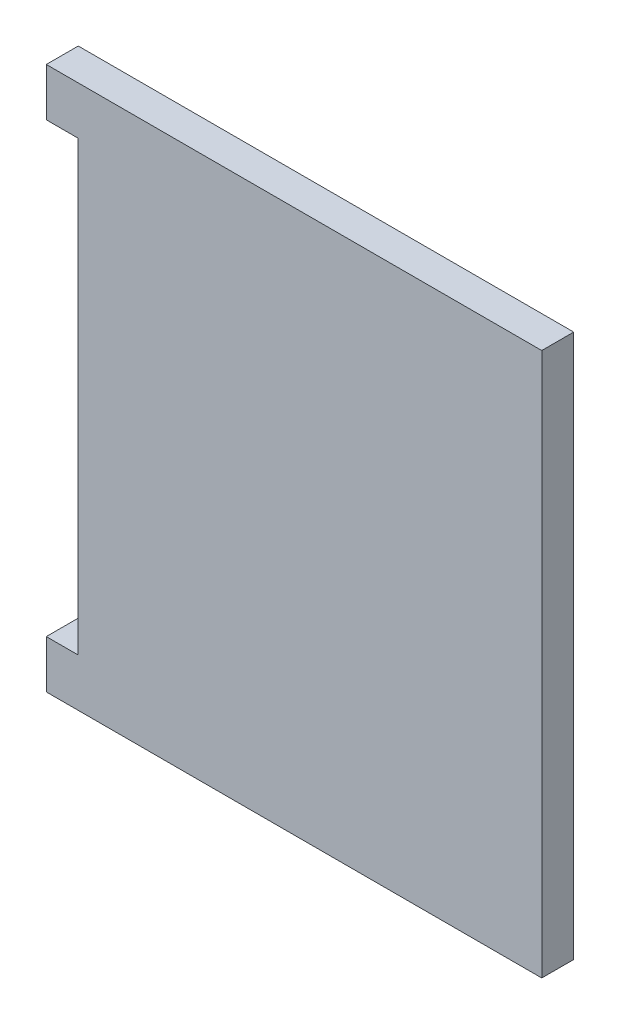
ISO-10303-21;
HEADER;
FILE_DESCRIPTION(('STEP AP214'),'2;1');
FILE_NAME('part.step','',(''),(''),'','','');
FILE_SCHEMA(('AUTOMOTIVE_DESIGN { 1 0 10303 214 1 1 1 1 }'));
ENDSEC;
DATA;
#1=APPLICATION_CONTEXT('core data for automotive mechanical design processes');
#2=APPLICATION_PROTOCOL_DEFINITION('international standard','automotive_design',2000,#1);
#3=PRODUCT_CONTEXT('',#1,'mechanical');
#4=PRODUCT('Part','Part','',(#3));
#5=PRODUCT_RELATED_PRODUCT_CATEGORY('part','',(#4));
#6=PRODUCT_DEFINITION_FORMATION('','',#4);
#7=PRODUCT_DEFINITION_CONTEXT('part definition',#1,'design');
#8=PRODUCT_DEFINITION('design','',#6,#7);
#9=PRODUCT_DEFINITION_SHAPE('','',#8);
#10=(LENGTH_UNIT() NAMED_UNIT(*) SI_UNIT(.MILLI.,.METRE.));
#11=(NAMED_UNIT(*) PLANE_ANGLE_UNIT() SI_UNIT($,.RADIAN.));
#12=(NAMED_UNIT(*) SI_UNIT($,.STERADIAN.) SOLID_ANGLE_UNIT());
#13=UNCERTAINTY_MEASURE_WITH_UNIT(LENGTH_MEASURE(1.E-05),#10,'distance_accuracy_value','');
#14=(GEOMETRIC_REPRESENTATION_CONTEXT(3) GLOBAL_UNCERTAINTY_ASSIGNED_CONTEXT((#13)) GLOBAL_UNIT_ASSIGNED_CONTEXT((#10,
#11,#12)) REPRESENTATION_CONTEXT('',''));
#15=CARTESIAN_POINT('',(0.,0.,0.));
#16=DIRECTION('',(0.,0.,1.));
#17=DIRECTION('',(1.,0.,0.));
#18=AXIS2_PLACEMENT_3D('',#15,#16,#17);
#19=CARTESIAN_POINT('',(0.,0.,12.7));
#20=DIRECTION('',(1.,0.,0.));
#21=DIRECTION('',(0.,1.,0.));
#22=AXIS2_PLACEMENT_3D('',#19,#20,#21);
#23=PLANE('',#22);
#24=DIRECTION('',(0.,-1.,0.));
#25=VECTOR('',#24,1.);
#26=CARTESIAN_POINT('',(0.,0.,0.));
#27=LINE('',#26,#25);
#28=CARTESIAN_POINT('',(0.,0.,0.));
#29=VERTEX_POINT('',#28);
#30=CARTESIAN_POINT('',(0.,-19.05,0.));
#31=VERTEX_POINT('',#30);
#32=EDGE_CURVE('E147',#29,#31,#27,.T.);
#33=ORIENTED_EDGE('',*,*,#32,.T.);
#34=DIRECTION('',(0.,0.,-1.));
#35=VECTOR('',#34,1.);
#36=CARTESIAN_POINT('',(0.,-19.05,12.7));
#37=LINE('',#36,#35);
#38=CARTESIAN_POINT('',(0.,-19.05,12.7));
#39=VERTEX_POINT('',#38);
#40=EDGE_CURVE('E136',#39,#31,#37,.T.);
#41=ORIENTED_EDGE('',*,*,#40,.F.);
#42=DIRECTION('',(0.,-1.,0.));
#43=VECTOR('',#42,1.);
#44=CARTESIAN_POINT('',(0.,0.,12.7));
#45=LINE('',#44,#43);
#46=CARTESIAN_POINT('',(0.,0.,12.7));
#47=VERTEX_POINT('',#46);
#48=EDGE_CURVE('E139',#47,#39,#45,.T.);
#49=ORIENTED_EDGE('',*,*,#48,.F.);
#50=DIRECTION('',(0.,0.,-1.));
#51=VECTOR('',#50,1.);
#52=CARTESIAN_POINT('',(0.,0.,12.7));
#53=LINE('',#52,#51);
#54=EDGE_CURVE('E146',#47,#29,#53,.T.);
#55=ORIENTED_EDGE('',*,*,#54,.T.);
#56=EDGE_LOOP('',(#33,#41,#49,#55));
#57=FACE_BOUND('',#56,.T.);
#58=ADVANCED_FACE('F35',(#57),#23,.F.);
#59=CARTESIAN_POINT('',(0.,-196.85,12.7));
#60=VERTEX_POINT('',#59);
#61=CARTESIAN_POINT('',(0.,-215.9,12.7));
#62=VERTEX_POINT('',#61);
#63=EDGE_CURVE('E87',#60,#62,#45,.T.);
#64=ORIENTED_EDGE('',*,*,#63,.F.);
#65=DIRECTION('',(0.,0.,-1.));
#66=VECTOR('',#65,1.);
#67=CARTESIAN_POINT('',(0.,-196.85,12.7));
#68=LINE('',#67,#66);
#69=CARTESIAN_POINT('',(0.,-196.85,0.));
#70=VERTEX_POINT('',#69);
#71=EDGE_CURVE('E116',#60,#70,#68,.T.);
#72=ORIENTED_EDGE('',*,*,#71,.T.);
#73=CARTESIAN_POINT('',(0.,-215.9,0.));
#74=VERTEX_POINT('',#73);
#75=EDGE_CURVE('E135',#70,#74,#27,.T.);
#76=ORIENTED_EDGE('',*,*,#75,.T.);
#77=DIRECTION('',(0.,0.,-1.));
#78=VECTOR('',#77,1.);
#79=CARTESIAN_POINT('',(0.,-215.9,12.7));
#80=LINE('',#79,#78);
#81=EDGE_CURVE('E11',#62,#74,#80,.T.);
#82=ORIENTED_EDGE('',*,*,#81,.F.);
#83=EDGE_LOOP('',(#64,#72,#76,#82));
#84=FACE_BOUND('',#83,.T.);
#85=ADVANCED_FACE('F37',(#84),#23,.F.);
#86=CARTESIAN_POINT('',(0.,-215.9,12.7));
#87=DIRECTION('',(0.,1.,0.));
#88=DIRECTION('',(0.,0.,1.));
#89=AXIS2_PLACEMENT_3D('',#86,#87,#88);
#90=PLANE('',#89);
#91=DIRECTION('',(1.,0.,0.));
#92=VECTOR('',#91,1.);
#93=CARTESIAN_POINT('',(0.,-215.9,0.));
#94=LINE('',#93,#92);
#95=CARTESIAN_POINT('',(196.85,-215.9,0.));
#96=VERTEX_POINT('',#95);
#97=EDGE_CURVE('E150',#74,#96,#94,.T.);
#98=ORIENTED_EDGE('',*,*,#97,.T.);
#99=DIRECTION('',(0.,0.,-1.));
#100=VECTOR('',#99,1.);
#101=CARTESIAN_POINT('',(196.85,-215.9,12.7));
#102=LINE('',#101,#100);
#103=CARTESIAN_POINT('',(196.85,-215.9,12.7));
#104=VERTEX_POINT('',#103);
#105=EDGE_CURVE('E43',#104,#96,#102,.T.);
#106=ORIENTED_EDGE('',*,*,#105,.F.);
#107=DIRECTION('',(1.,0.,0.));
#108=VECTOR('',#107,1.);
#109=CARTESIAN_POINT('',(0.,-215.9,12.7));
#110=LINE('',#109,#108);
#111=EDGE_CURVE('E141',#62,#104,#110,.T.);
#112=ORIENTED_EDGE('',*,*,#111,.F.);
#113=ORIENTED_EDGE('',*,*,#81,.T.);
#114=EDGE_LOOP('',(#98,#106,#112,#113));
#115=FACE_BOUND('',#114,.T.);
#116=ADVANCED_FACE('F182',(#115),#90,.F.);
#117=CARTESIAN_POINT('',(196.85,0.,12.7));
#118=DIRECTION('',(-1.,0.,0.));
#119=DIRECTION('',(0.,-1.,0.));
#120=AXIS2_PLACEMENT_3D('',#117,#118,#119);
#121=PLANE('',#120);
#122=DIRECTION('',(0.,1.,0.));
#123=VECTOR('',#122,1.);
#124=CARTESIAN_POINT('',(196.85,0.,0.));
#125=LINE('',#124,#123);
#126=CARTESIAN_POINT('',(196.85,0.,0.));
#127=VERTEX_POINT('',#126);
#128=EDGE_CURVE('E152',#96,#127,#125,.T.);
#129=ORIENTED_EDGE('',*,*,#128,.T.);
#130=DIRECTION('',(0.,0.,-1.));
#131=VECTOR('',#130,1.);
#132=CARTESIAN_POINT('',(196.85,0.,12.7));
#133=LINE('',#132,#131);
#134=CARTESIAN_POINT('',(196.85,0.,12.7));
#135=VERTEX_POINT('',#134);
#136=EDGE_CURVE('E156',#135,#127,#133,.T.);
#137=ORIENTED_EDGE('',*,*,#136,.F.);
#138=DIRECTION('',(0.,1.,0.));
#139=VECTOR('',#138,1.);
#140=CARTESIAN_POINT('',(196.85,0.,12.7));
#141=LINE('',#140,#139);
#142=EDGE_CURVE('E143',#104,#135,#141,.T.);
#143=ORIENTED_EDGE('',*,*,#142,.F.);
#144=ORIENTED_EDGE('',*,*,#105,.T.);
#145=EDGE_LOOP('',(#129,#137,#143,#144));
#146=FACE_BOUND('',#145,.T.);
#147=ADVANCED_FACE('F162',(#146),#121,.F.);
#148=CARTESIAN_POINT('',(0.,0.,12.7));
#149=DIRECTION('',(0.,-1.,0.));
#150=DIRECTION('',(0.,0.,-1.));
#151=AXIS2_PLACEMENT_3D('',#148,#149,#150);
#152=PLANE('',#151);
#153=DIRECTION('',(-1.,0.,0.));
#154=VECTOR('',#153,1.);
#155=CARTESIAN_POINT('',(0.,0.,0.));
#156=LINE('',#155,#154);
#157=EDGE_CURVE('E80',#127,#29,#156,.T.);
#158=ORIENTED_EDGE('',*,*,#157,.T.);
#159=ORIENTED_EDGE('',*,*,#54,.F.);
#160=DIRECTION('',(-1.,0.,0.));
#161=VECTOR('',#160,1.);
#162=CARTESIAN_POINT('',(0.,0.,12.7));
#163=LINE('',#162,#161);
#164=EDGE_CURVE('E59',#135,#47,#163,.T.);
#165=ORIENTED_EDGE('',*,*,#164,.F.);
#166=ORIENTED_EDGE('',*,*,#136,.T.);
#167=EDGE_LOOP('',(#158,#159,#165,#166));
#168=FACE_BOUND('',#167,.T.);
#169=ADVANCED_FACE('F174',(#168),#152,.F.);
#170=CARTESIAN_POINT('',(0.,0.,12.7));
#171=DIRECTION('',(0.,0.,1.));
#172=DIRECTION('',(1.,0.,0.));
#173=AXIS2_PLACEMENT_3D('',#170,#171,#172);
#174=PLANE('',#173);
#175=DIRECTION('',(1.,0.,0.));
#176=VECTOR('',#175,1.);
#177=CARTESIAN_POINT('',(12.7,-19.05,12.7));
#178=LINE('',#177,#176);
#179=CARTESIAN_POINT('',(12.7,-19.05,12.7));
#180=VERTEX_POINT('',#179);
#181=EDGE_CURVE('E117',#39,#180,#178,.T.);
#182=ORIENTED_EDGE('',*,*,#181,.T.);
#183=DIRECTION('',(0.,-1.,0.));
#184=VECTOR('',#183,1.);
#185=CARTESIAN_POINT('',(12.7,-19.05,12.7));
#186=LINE('',#185,#184);
#187=CARTESIAN_POINT('',(12.7,-196.85,12.7));
#188=VERTEX_POINT('',#187);
#189=EDGE_CURVE('E112',#180,#188,#186,.T.);
#190=ORIENTED_EDGE('',*,*,#189,.T.);
#191=DIRECTION('',(-1.,0.,0.));
#192=VECTOR('',#191,1.);
#193=CARTESIAN_POINT('',(12.7,-196.85,12.7));
#194=LINE('',#193,#192);
#195=EDGE_CURVE('E119',#188,#60,#194,.T.);
#196=ORIENTED_EDGE('',*,*,#195,.T.);
#197=ORIENTED_EDGE('',*,*,#63,.T.);
#198=ORIENTED_EDGE('',*,*,#111,.T.);
#199=ORIENTED_EDGE('',*,*,#142,.T.);
#200=ORIENTED_EDGE('',*,*,#164,.T.);
#201=ORIENTED_EDGE('',*,*,#48,.T.);
#202=EDGE_LOOP('',(#182,#190,#196,#197,#198,#199,#200,#201));
#203=FACE_BOUND('',#202,.T.);
#204=ADVANCED_FACE('F123',(#203),#174,.T.);
#205=CARTESIAN_POINT('',(0.,0.,0.));
#206=DIRECTION('',(0.,0.,1.));
#207=DIRECTION('',(1.,0.,0.));
#208=AXIS2_PLACEMENT_3D('',#205,#206,#207);
#209=PLANE('',#208);
#210=DIRECTION('',(0.,-1.,0.));
#211=VECTOR('',#210,1.);
#212=CARTESIAN_POINT('',(12.7,-19.05,0.));
#213=LINE('',#212,#211);
#214=CARTESIAN_POINT('',(12.7,-19.05,0.));
#215=VERTEX_POINT('',#214);
#216=CARTESIAN_POINT('',(12.7,-196.85,0.));
#217=VERTEX_POINT('',#216);
#218=EDGE_CURVE('E50',#215,#217,#213,.T.);
#219=ORIENTED_EDGE('',*,*,#218,.F.);
#220=DIRECTION('',(1.,0.,0.));
#221=VECTOR('',#220,1.);
#222=CARTESIAN_POINT('',(12.7,-19.05,0.));
#223=LINE('',#222,#221);
#224=EDGE_CURVE('E124',#31,#215,#223,.T.);
#225=ORIENTED_EDGE('',*,*,#224,.F.);
#226=ORIENTED_EDGE('',*,*,#32,.F.);
#227=ORIENTED_EDGE('',*,*,#157,.F.);
#228=ORIENTED_EDGE('',*,*,#128,.F.);
#229=ORIENTED_EDGE('',*,*,#97,.F.);
#230=ORIENTED_EDGE('',*,*,#75,.F.);
#231=DIRECTION('',(-1.,0.,0.));
#232=VECTOR('',#231,1.);
#233=CARTESIAN_POINT('',(12.7,-196.85,0.));
#234=LINE('',#233,#232);
#235=EDGE_CURVE('E127',#217,#70,#234,.T.);
#236=ORIENTED_EDGE('',*,*,#235,.F.);
#237=EDGE_LOOP('',(#219,#225,#226,#227,#228,#229,#230,#236));
#238=FACE_BOUND('',#237,.T.);
#239=ADVANCED_FACE('F167',(#238),#209,.F.);
#240=CARTESIAN_POINT('',(12.7,-19.05,12.7));
#241=DIRECTION('',(1.,0.,0.));
#242=DIRECTION('',(0.,1.,0.));
#243=AXIS2_PLACEMENT_3D('',#240,#241,#242);
#244=PLANE('',#243);
#245=ORIENTED_EDGE('',*,*,#218,.T.);
#246=DIRECTION('',(0.,0.,-1.));
#247=VECTOR('',#246,1.);
#248=CARTESIAN_POINT('',(12.7,-196.85,12.7));
#249=LINE('',#248,#247);
#250=EDGE_CURVE('E108',#188,#217,#249,.T.);
#251=ORIENTED_EDGE('',*,*,#250,.F.);
#252=ORIENTED_EDGE('',*,*,#189,.F.);
#253=DIRECTION('',(0.,0.,-1.));
#254=VECTOR('',#253,1.);
#255=CARTESIAN_POINT('',(12.7,-19.05,12.7));
#256=LINE('',#255,#254);
#257=EDGE_CURVE('E133',#180,#215,#256,.T.);
#258=ORIENTED_EDGE('',*,*,#257,.T.);
#259=EDGE_LOOP('',(#245,#251,#252,#258));
#260=FACE_BOUND('',#259,.T.);
#261=ADVANCED_FACE('F110',(#260),#244,.F.);
#262=CARTESIAN_POINT('',(12.7,-19.05,12.7));
#263=DIRECTION('',(0.,1.,0.));
#264=DIRECTION('',(-1.,0.,0.));
#265=AXIS2_PLACEMENT_3D('',#262,#263,#264);
#266=PLANE('',#265);
#267=ORIENTED_EDGE('',*,*,#224,.T.);
#268=ORIENTED_EDGE('',*,*,#257,.F.);
#269=ORIENTED_EDGE('',*,*,#181,.F.);
#270=ORIENTED_EDGE('',*,*,#40,.T.);
#271=EDGE_LOOP('',(#267,#268,#269,#270));
#272=FACE_BOUND('',#271,.T.);
#273=ADVANCED_FACE('F234',(#272),#266,.F.);
#274=CARTESIAN_POINT('',(12.7,-196.85,12.7));
#275=DIRECTION('',(0.,-1.,0.));
#276=DIRECTION('',(1.,0.,0.));
#277=AXIS2_PLACEMENT_3D('',#274,#275,#276);
#278=PLANE('',#277);
#279=ORIENTED_EDGE('',*,*,#235,.T.);
#280=ORIENTED_EDGE('',*,*,#71,.F.);
#281=ORIENTED_EDGE('',*,*,#195,.F.);
#282=ORIENTED_EDGE('',*,*,#250,.T.);
#283=EDGE_LOOP('',(#279,#280,#281,#282));
#284=FACE_BOUND('',#283,.T.);
#285=ADVANCED_FACE('F120',(#284),#278,.F.);
#286=CLOSED_SHELL('',(#58,#85,#116,#147,#169,#204,#239,#261,#273,#285));
#287=MANIFOLD_SOLID_BREP('B2',#286);
#288=ADVANCED_BREP_SHAPE_REPRESENTATION('',(#18,#287),#14);
#289=SHAPE_DEFINITION_REPRESENTATION(#9,#288);
ENDSEC;
END-ISO-10303-21;
